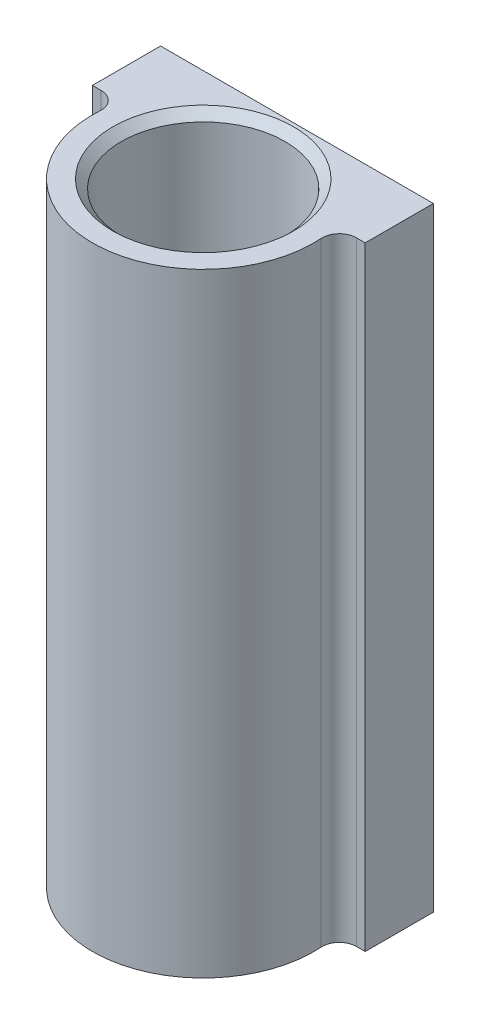
ISO-10303-21;
HEADER;
FILE_DESCRIPTION(('STEP AP214'),'2;1');
FILE_NAME('part.step','',(''),(''),'','','');
FILE_SCHEMA(('AUTOMOTIVE_DESIGN { 1 0 10303 214 1 1 1 1 }'));
ENDSEC;
DATA;
#1=APPLICATION_CONTEXT('core data for automotive mechanical design processes');
#2=APPLICATION_PROTOCOL_DEFINITION('international standard','automotive_design',2000,#1);
#3=PRODUCT_CONTEXT('',#1,'mechanical');
#4=PRODUCT('Part','Part','',(#3));
#5=PRODUCT_RELATED_PRODUCT_CATEGORY('part','',(#4));
#6=PRODUCT_DEFINITION_FORMATION('','',#4);
#7=PRODUCT_DEFINITION_CONTEXT('part definition',#1,'design');
#8=PRODUCT_DEFINITION('design','',#6,#7);
#9=PRODUCT_DEFINITION_SHAPE('','',#8);
#10=(LENGTH_UNIT() NAMED_UNIT(*) SI_UNIT(.MILLI.,.METRE.));
#11=(NAMED_UNIT(*) PLANE_ANGLE_UNIT() SI_UNIT($,.RADIAN.));
#12=(NAMED_UNIT(*) SI_UNIT($,.STERADIAN.) SOLID_ANGLE_UNIT());
#13=UNCERTAINTY_MEASURE_WITH_UNIT(LENGTH_MEASURE(1.E-05),#10,'distance_accuracy_value','');
#14=(GEOMETRIC_REPRESENTATION_CONTEXT(3) GLOBAL_UNCERTAINTY_ASSIGNED_CONTEXT((#13)) GLOBAL_UNIT_ASSIGNED_CONTEXT((#10,
#11,#12)) REPRESENTATION_CONTEXT('',''));
#15=CARTESIAN_POINT('',(0.,0.,0.));
#16=DIRECTION('',(0.,0.,1.));
#17=DIRECTION('',(1.,0.,0.));
#18=AXIS2_PLACEMENT_3D('',#15,#16,#17);
#19=CARTESIAN_POINT('',(-16.,72.,-11.));
#20=DIRECTION('',(0.,0.,1.));
#21=DIRECTION('',(1.,0.,0.));
#22=AXIS2_PLACEMENT_3D('',#19,#20,#21);
#23=PLANE('',#22);
#24=CARTESIAN_POINT('',(-11.,5.,-11.));
#25=DIRECTION('',(0.,0.,1.));
#26=DIRECTION('',(1.,0.,0.));
#27=AXIS2_PLACEMENT_3D('',#24,#25,#26);
#28=CIRCLE('',#27,3.10000000000001);
#29=CARTESIAN_POINT('',(-7.89999999999999,5.,-11.));
#30=VERTEX_POINT('',#29);
#31=EDGE_CURVE('E170',#30,#30,#28,.T.);
#32=ORIENTED_EDGE('',*,*,#31,.T.);
#33=EDGE_LOOP('',(#32));
#34=FACE_BOUND('',#33,.T.);
#35=CARTESIAN_POINT('',(11.,5.,-11.));
#36=DIRECTION('',(0.,0.,1.));
#37=DIRECTION('',(1.,0.,0.));
#38=AXIS2_PLACEMENT_3D('',#35,#36,#37);
#39=CIRCLE('',#38,3.09999999999999);
#40=CARTESIAN_POINT('',(14.1,5.,-11.));
#41=VERTEX_POINT('',#40);
#42=EDGE_CURVE('E167',#41,#41,#39,.T.);
#43=ORIENTED_EDGE('',*,*,#42,.T.);
#44=EDGE_LOOP('',(#43));
#45=FACE_BOUND('',#44,.T.);
#46=CARTESIAN_POINT('',(11.,67.,-11.));
#47=DIRECTION('',(0.,0.,1.));
#48=DIRECTION('',(1.,0.,0.));
#49=AXIS2_PLACEMENT_3D('',#46,#47,#48);
#50=CIRCLE('',#49,3.10000000000001);
#51=CARTESIAN_POINT('',(14.1,67.,-11.));
#52=VERTEX_POINT('',#51);
#53=EDGE_CURVE('E164',#52,#52,#50,.T.);
#54=ORIENTED_EDGE('',*,*,#53,.T.);
#55=EDGE_LOOP('',(#54));
#56=FACE_BOUND('',#55,.T.);
#57=CARTESIAN_POINT('',(-11.,67.,-11.));
#58=DIRECTION('',(0.,0.,1.));
#59=DIRECTION('',(1.,0.,0.));
#60=AXIS2_PLACEMENT_3D('',#57,#58,#59);
#61=CIRCLE('',#60,3.10000000000001);
#62=CARTESIAN_POINT('',(-7.89999999999999,67.,-11.));
#63=VERTEX_POINT('',#62);
#64=EDGE_CURVE('E161',#63,#63,#61,.T.);
#65=ORIENTED_EDGE('',*,*,#64,.T.);
#66=EDGE_LOOP('',(#65));
#67=FACE_BOUND('',#66,.T.);
#68=DIRECTION('',(-1.,0.,0.));
#69=VECTOR('',#68,1.);
#70=CARTESIAN_POINT('',(-16.,0.,-11.));
#71=LINE('',#70,#69);
#72=CARTESIAN_POINT('',(16.,0.,-11.));
#73=VERTEX_POINT('',#72);
#74=CARTESIAN_POINT('',(-16.,0.,-11.));
#75=VERTEX_POINT('',#74);
#76=EDGE_CURVE('E85',#73,#75,#71,.T.);
#77=ORIENTED_EDGE('',*,*,#76,.T.);
#78=DIRECTION('',(0.,-1.,0.));
#79=VECTOR('',#78,1.);
#80=CARTESIAN_POINT('',(-16.,72.,-11.));
#81=LINE('',#80,#79);
#82=CARTESIAN_POINT('',(-16.,72.,-11.));
#83=VERTEX_POINT('',#82);
#84=EDGE_CURVE('E127',#83,#75,#81,.T.);
#85=ORIENTED_EDGE('',*,*,#84,.F.);
#86=DIRECTION('',(-1.,0.,0.));
#87=VECTOR('',#86,1.);
#88=CARTESIAN_POINT('',(-16.,72.,-11.));
#89=LINE('',#88,#87);
#90=CARTESIAN_POINT('',(16.,72.,-11.));
#91=VERTEX_POINT('',#90);
#92=EDGE_CURVE('E50',#91,#83,#89,.T.);
#93=ORIENTED_EDGE('',*,*,#92,.F.);
#94=DIRECTION('',(0.,-1.,0.));
#95=VECTOR('',#94,1.);
#96=CARTESIAN_POINT('',(16.,72.,-11.));
#97=LINE('',#96,#95);
#98=EDGE_CURVE('E123',#91,#73,#97,.T.);
#99=ORIENTED_EDGE('',*,*,#98,.T.);
#100=EDGE_LOOP('',(#77,#85,#93,#99));
#101=FACE_BOUND('',#100,.T.);
#102=ADVANCED_FACE('F33',(#34,#45,#56,#67,#101),#23,.F.);
#103=CARTESIAN_POINT('',(-14.9666295470958,72.,-0.999999999999999));
#104=DIRECTION('',(0.,1.,0.));
#105=DIRECTION('',(0.,0.,1.));
#106=AXIS2_PLACEMENT_3D('',#103,#104,#105);
#107=PLANE('',#106);
#108=CARTESIAN_POINT('',(0.,72.,0.));
#109=DIRECTION('',(0.,1.,0.));
#110=DIRECTION('',(0.,0.,1.));
#111=AXIS2_PLACEMENT_3D('',#108,#109,#110);
#112=CIRCLE('',#111,10.6);
#113=CARTESIAN_POINT('',(0.,72.,10.6));
#114=VERTEX_POINT('',#113);
#115=EDGE_CURVE('E11',#114,#114,#112,.F.);
#116=ORIENTED_EDGE('',*,*,#115,.T.);
#117=EDGE_LOOP('',(#116));
#118=FACE_BOUND('',#117,.T.);
#119=DIRECTION('',(0.,0.,1.));
#120=VECTOR('',#119,1.);
#121=CARTESIAN_POINT('',(-16.,72.,-11.));
#122=LINE('',#121,#120);
#123=CARTESIAN_POINT('',(-16.,72.,-3.));
#124=VERTEX_POINT('',#123);
#125=EDGE_CURVE('E146',#83,#124,#122,.T.);
#126=ORIENTED_EDGE('',*,*,#125,.T.);
#127=DIRECTION('',(1.,0.,0.));
#128=VECTOR('',#127,1.);
#129=CARTESIAN_POINT('',(-16.,72.,-3.));
#130=LINE('',#129,#128);
#131=CARTESIAN_POINT('',(-14.9666295470958,72.,-3.));
#132=VERTEX_POINT('',#131);
#133=EDGE_CURVE('E94',#124,#132,#130,.T.);
#134=ORIENTED_EDGE('',*,*,#133,.T.);
#135=CARTESIAN_POINT('',(-14.9666295470958,72.,-0.999999999999999));
#136=DIRECTION('',(0.,-1.,0.));
#137=DIRECTION('',(0.,0.,1.));
#138=AXIS2_PLACEMENT_3D('',#135,#136,#137);
#139=CIRCLE('',#138,2.);
#140=CARTESIAN_POINT('',(-12.9710789408163,72.,-0.866666666666666));
#141=VERTEX_POINT('',#140);
#142=EDGE_CURVE('E282',#132,#141,#139,.T.);
#143=ORIENTED_EDGE('',*,*,#142,.T.);
#144=CARTESIAN_POINT('',(0.,72.,0.));
#145=DIRECTION('',(0.,1.,0.));
#146=DIRECTION('',(0.,0.,1.));
#147=AXIS2_PLACEMENT_3D('',#144,#145,#146);
#148=CIRCLE('',#147,13.);
#149=CARTESIAN_POINT('',(12.9710789408163,72.,-0.866666666666667));
#150=VERTEX_POINT('',#149);
#151=EDGE_CURVE('E284',#141,#150,#148,.T.);
#152=ORIENTED_EDGE('',*,*,#151,.T.);
#153=CARTESIAN_POINT('',(14.9666295470958,72.,-0.999999999999999));
#154=DIRECTION('',(0.,-1.,0.));
#155=DIRECTION('',(0.,0.,1.));
#156=AXIS2_PLACEMENT_3D('',#153,#154,#155);
#157=CIRCLE('',#156,2.);
#158=CARTESIAN_POINT('',(14.9666295470958,72.,-3.));
#159=VERTEX_POINT('',#158);
#160=EDGE_CURVE('E113',#150,#159,#157,.T.);
#161=ORIENTED_EDGE('',*,*,#160,.T.);
#162=DIRECTION('',(1.,0.,0.));
#163=VECTOR('',#162,1.);
#164=CARTESIAN_POINT('',(14.9666295470958,72.,-3.));
#165=LINE('',#164,#163);
#166=CARTESIAN_POINT('',(16.,72.,-3.));
#167=VERTEX_POINT('',#166);
#168=EDGE_CURVE('E107',#159,#167,#165,.T.);
#169=ORIENTED_EDGE('',*,*,#168,.T.);
#170=DIRECTION('',(0.,0.,-1.));
#171=VECTOR('',#170,1.);
#172=CARTESIAN_POINT('',(16.,72.,-11.));
#173=LINE('',#172,#171);
#174=EDGE_CURVE('E111',#167,#91,#173,.T.);
#175=ORIENTED_EDGE('',*,*,#174,.T.);
#176=ORIENTED_EDGE('',*,*,#92,.T.);
#177=EDGE_LOOP('',(#126,#134,#143,#152,#161,#169,#175,#176));
#178=FACE_BOUND('',#177,.T.);
#179=ADVANCED_FACE('F109',(#118,#178),#107,.T.);
#180=CARTESIAN_POINT('',(-14.9666295470958,0.,-0.999999999999999));
#181=DIRECTION('',(0.,1.,0.));
#182=DIRECTION('',(0.,0.,1.));
#183=AXIS2_PLACEMENT_3D('',#180,#181,#182);
#184=PLANE('',#183);
#185=CARTESIAN_POINT('',(0.,0.,0.));
#186=DIRECTION('',(0.,1.,0.));
#187=DIRECTION('',(0.,0.,1.));
#188=AXIS2_PLACEMENT_3D('',#185,#186,#187);
#189=CIRCLE('',#188,10.6);
#190=CARTESIAN_POINT('',(0.,0.,10.6));
#191=VERTEX_POINT('',#190);
#192=EDGE_CURVE('E185',#191,#191,#189,.T.);
#193=ORIENTED_EDGE('',*,*,#192,.T.);
#194=EDGE_LOOP('',(#193));
#195=FACE_BOUND('',#194,.T.);
#196=DIRECTION('',(0.,0.,1.));
#197=VECTOR('',#196,1.);
#198=CARTESIAN_POINT('',(-16.,0.,-11.));
#199=LINE('',#198,#197);
#200=CARTESIAN_POINT('',(-16.,0.,-3.));
#201=VERTEX_POINT('',#200);
#202=EDGE_CURVE('E131',#75,#201,#199,.T.);
#203=ORIENTED_EDGE('',*,*,#202,.F.);
#204=ORIENTED_EDGE('',*,*,#76,.F.);
#205=DIRECTION('',(0.,0.,-1.));
#206=VECTOR('',#205,1.);
#207=CARTESIAN_POINT('',(16.,0.,-11.));
#208=LINE('',#207,#206);
#209=CARTESIAN_POINT('',(16.,0.,-3.));
#210=VERTEX_POINT('',#209);
#211=EDGE_CURVE('E79',#210,#73,#208,.T.);
#212=ORIENTED_EDGE('',*,*,#211,.F.);
#213=DIRECTION('',(1.,0.,0.));
#214=VECTOR('',#213,1.);
#215=CARTESIAN_POINT('',(14.9666295470958,0.,-3.));
#216=LINE('',#215,#214);
#217=CARTESIAN_POINT('',(14.9666295470958,0.,-3.));
#218=VERTEX_POINT('',#217);
#219=EDGE_CURVE('E121',#218,#210,#216,.T.);
#220=ORIENTED_EDGE('',*,*,#219,.F.);
#221=CARTESIAN_POINT('',(14.9666295470958,0.,-0.999999999999999));
#222=DIRECTION('',(0.,-1.,0.));
#223=DIRECTION('',(0.,0.,1.));
#224=AXIS2_PLACEMENT_3D('',#221,#222,#223);
#225=CIRCLE('',#224,2.);
#226=CARTESIAN_POINT('',(12.9710789408163,0.,-0.866666666666667));
#227=VERTEX_POINT('',#226);
#228=EDGE_CURVE('E141',#227,#218,#225,.T.);
#229=ORIENTED_EDGE('',*,*,#228,.F.);
#230=CARTESIAN_POINT('',(0.,0.,0.));
#231=DIRECTION('',(0.,1.,0.));
#232=DIRECTION('',(0.,0.,1.));
#233=AXIS2_PLACEMENT_3D('',#230,#231,#232);
#234=CIRCLE('',#233,13.);
#235=CARTESIAN_POINT('',(-12.9710789408163,0.,-0.866666666666666));
#236=VERTEX_POINT('',#235);
#237=EDGE_CURVE('E139',#236,#227,#234,.T.);
#238=ORIENTED_EDGE('',*,*,#237,.F.);
#239=CARTESIAN_POINT('',(-14.9666295470958,0.,-0.999999999999999));
#240=DIRECTION('',(0.,-1.,0.));
#241=DIRECTION('',(0.,0.,1.));
#242=AXIS2_PLACEMENT_3D('',#239,#240,#241);
#243=CIRCLE('',#242,2.);
#244=CARTESIAN_POINT('',(-14.9666295470958,0.,-3.));
#245=VERTEX_POINT('',#244);
#246=EDGE_CURVE('E137',#245,#236,#243,.T.);
#247=ORIENTED_EDGE('',*,*,#246,.F.);
#248=DIRECTION('',(1.,0.,0.));
#249=VECTOR('',#248,1.);
#250=CARTESIAN_POINT('',(-16.,0.,-3.));
#251=LINE('',#250,#249);
#252=EDGE_CURVE('E134',#201,#245,#251,.T.);
#253=ORIENTED_EDGE('',*,*,#252,.F.);
#254=EDGE_LOOP('',(#203,#204,#212,#220,#229,#238,#247,#253));
#255=FACE_BOUND('',#254,.T.);
#256=ADVANCED_FACE('F202',(#195,#255),#184,.F.);
#257=CARTESIAN_POINT('',(-16.,72.,-11.));
#258=DIRECTION('',(1.,0.,0.));
#259=DIRECTION('',(0.,0.,-1.));
#260=AXIS2_PLACEMENT_3D('',#257,#258,#259);
#261=PLANE('',#260);
#262=ORIENTED_EDGE('',*,*,#202,.T.);
#263=DIRECTION('',(0.,-1.,0.));
#264=VECTOR('',#263,1.);
#265=CARTESIAN_POINT('',(-16.,72.,-3.));
#266=LINE('',#265,#264);
#267=EDGE_CURVE('E159',#124,#201,#266,.T.);
#268=ORIENTED_EDGE('',*,*,#267,.F.);
#269=ORIENTED_EDGE('',*,*,#125,.F.);
#270=ORIENTED_EDGE('',*,*,#84,.T.);
#271=EDGE_LOOP('',(#262,#268,#269,#270));
#272=FACE_BOUND('',#271,.T.);
#273=ADVANCED_FACE('F205',(#272),#261,.F.);
#274=CARTESIAN_POINT('',(-16.,72.,-3.));
#275=DIRECTION('',(0.,0.,-1.));
#276=DIRECTION('',(-1.,0.,0.));
#277=AXIS2_PLACEMENT_3D('',#274,#275,#276);
#278=PLANE('',#277);
#279=ORIENTED_EDGE('',*,*,#252,.T.);
#280=DIRECTION('',(0.,-1.,0.));
#281=VECTOR('',#280,1.);
#282=CARTESIAN_POINT('',(-14.9666295470958,72.,-3.));
#283=LINE('',#282,#281);
#284=EDGE_CURVE('E156',#132,#245,#283,.T.);
#285=ORIENTED_EDGE('',*,*,#284,.F.);
#286=ORIENTED_EDGE('',*,*,#133,.F.);
#287=ORIENTED_EDGE('',*,*,#267,.T.);
#288=EDGE_LOOP('',(#279,#285,#286,#287));
#289=FACE_BOUND('',#288,.T.);
#290=ADVANCED_FACE('F237',(#289),#278,.F.);
#291=CARTESIAN_POINT('',(-14.9666295470958,72.,-0.999999999999999));
#292=DIRECTION('',(0.,-1.,0.));
#293=DIRECTION('',(0.,0.,-1.));
#294=AXIS2_PLACEMENT_3D('',#291,#292,#293);
#295=CYLINDRICAL_SURFACE('',#294,2.);
#296=ORIENTED_EDGE('',*,*,#246,.T.);
#297=DIRECTION('',(0.,-1.,0.));
#298=VECTOR('',#297,1.);
#299=CARTESIAN_POINT('',(-12.9710789408163,72.,-0.866666666666666));
#300=LINE('',#299,#298);
#301=EDGE_CURVE('E153',#141,#236,#300,.T.);
#302=ORIENTED_EDGE('',*,*,#301,.F.);
#303=ORIENTED_EDGE('',*,*,#142,.F.);
#304=ORIENTED_EDGE('',*,*,#284,.T.);
#305=EDGE_LOOP('',(#296,#302,#303,#304));
#306=FACE_BOUND('',#305,.T.);
#307=ADVANCED_FACE('F233',(#306),#295,.F.);
#308=CARTESIAN_POINT('',(0.,72.,0.));
#309=DIRECTION('',(0.,-1.,0.));
#310=DIRECTION('',(0.,0.,-1.));
#311=AXIS2_PLACEMENT_3D('',#308,#309,#310);
#312=CYLINDRICAL_SURFACE('',#311,13.);
#313=ORIENTED_EDGE('',*,*,#237,.T.);
#314=DIRECTION('',(0.,-1.,0.));
#315=VECTOR('',#314,1.);
#316=CARTESIAN_POINT('',(12.9710789408163,72.,-0.866666666666667));
#317=LINE('',#316,#315);
#318=EDGE_CURVE('E150',#150,#227,#317,.T.);
#319=ORIENTED_EDGE('',*,*,#318,.F.);
#320=ORIENTED_EDGE('',*,*,#151,.F.);
#321=ORIENTED_EDGE('',*,*,#301,.T.);
#322=EDGE_LOOP('',(#313,#319,#320,#321));
#323=FACE_BOUND('',#322,.T.);
#324=ADVANCED_FACE('F229',(#323),#312,.T.);
#325=CARTESIAN_POINT('',(14.9666295470958,72.,-0.999999999999999));
#326=DIRECTION('',(0.,-1.,0.));
#327=DIRECTION('',(0.,0.,-1.));
#328=AXIS2_PLACEMENT_3D('',#325,#326,#327);
#329=CYLINDRICAL_SURFACE('',#328,2.);
#330=ORIENTED_EDGE('',*,*,#228,.T.);
#331=DIRECTION('',(0.,-1.,0.));
#332=VECTOR('',#331,1.);
#333=CARTESIAN_POINT('',(14.9666295470958,72.,-3.));
#334=LINE('',#333,#332);
#335=EDGE_CURVE('E122',#159,#218,#334,.T.);
#336=ORIENTED_EDGE('',*,*,#335,.F.);
#337=ORIENTED_EDGE('',*,*,#160,.F.);
#338=ORIENTED_EDGE('',*,*,#318,.T.);
#339=EDGE_LOOP('',(#330,#336,#337,#338));
#340=FACE_BOUND('',#339,.T.);
#341=ADVANCED_FACE('F226',(#340),#329,.F.);
#342=CARTESIAN_POINT('',(14.9666295470958,72.,-3.));
#343=DIRECTION('',(0.,0.,-1.));
#344=DIRECTION('',(-1.,0.,0.));
#345=AXIS2_PLACEMENT_3D('',#342,#343,#344);
#346=PLANE('',#345);
#347=ORIENTED_EDGE('',*,*,#219,.T.);
#348=DIRECTION('',(0.,-1.,0.));
#349=VECTOR('',#348,1.);
#350=CARTESIAN_POINT('',(16.,72.,-3.));
#351=LINE('',#350,#349);
#352=EDGE_CURVE('E118',#167,#210,#351,.T.);
#353=ORIENTED_EDGE('',*,*,#352,.F.);
#354=ORIENTED_EDGE('',*,*,#168,.F.);
#355=ORIENTED_EDGE('',*,*,#335,.T.);
#356=EDGE_LOOP('',(#347,#353,#354,#355));
#357=FACE_BOUND('',#356,.T.);
#358=ADVANCED_FACE('F119',(#357),#346,.F.);
#359=CARTESIAN_POINT('',(16.,72.,-11.));
#360=DIRECTION('',(-1.,0.,0.));
#361=DIRECTION('',(0.,0.,1.));
#362=AXIS2_PLACEMENT_3D('',#359,#360,#361);
#363=PLANE('',#362);
#364=ORIENTED_EDGE('',*,*,#211,.T.);
#365=ORIENTED_EDGE('',*,*,#98,.F.);
#366=ORIENTED_EDGE('',*,*,#174,.F.);
#367=ORIENTED_EDGE('',*,*,#352,.T.);
#368=EDGE_LOOP('',(#364,#365,#366,#367));
#369=FACE_BOUND('',#368,.T.);
#370=ADVANCED_FACE('F125',(#369),#363,.F.);
#371=CARTESIAN_POINT('',(0.,72.,0.));
#372=DIRECTION('',(0.,-1.,0.));
#373=DIRECTION('',(0.,0.,-1.));
#374=AXIS2_PLACEMENT_3D('',#371,#372,#373);
#375=CYLINDRICAL_SURFACE('',#374,9.6);
#376=CARTESIAN_POINT('',(0.,1.,0.));
#377=DIRECTION('',(0.,1.,0.));
#378=DIRECTION('',(0.,0.,1.));
#379=AXIS2_PLACEMENT_3D('',#376,#377,#378);
#380=CIRCLE('',#379,9.6);
#381=CARTESIAN_POINT('',(0.,1.,9.6));
#382=VERTEX_POINT('',#381);
#383=EDGE_CURVE('E42',#382,#382,#380,.F.);
#384=ORIENTED_EDGE('',*,*,#383,.T.);
#385=EDGE_LOOP('',(#384));
#386=FACE_BOUND('',#385,.T.);
#387=CARTESIAN_POINT('',(0.,71.,0.));
#388=DIRECTION('',(0.,1.,0.));
#389=DIRECTION('',(0.,0.,1.));
#390=AXIS2_PLACEMENT_3D('',#387,#388,#389);
#391=CIRCLE('',#390,9.6);
#392=CARTESIAN_POINT('',(0.,71.,9.6));
#393=VERTEX_POINT('',#392);
#394=EDGE_CURVE('E188',#393,#393,#391,.T.);
#395=ORIENTED_EDGE('',*,*,#394,.T.);
#396=EDGE_LOOP('',(#395));
#397=FACE_BOUND('',#396,.T.);
#398=ADVANCED_FACE('F193',(#386,#397),#375,.F.);
#399=CARTESIAN_POINT('',(-11.,67.,-5.));
#400=DIRECTION('',(0.,0.,-1.));
#401=DIRECTION('',(-1.,0.,0.));
#402=AXIS2_PLACEMENT_3D('',#399,#400,#401);
#403=CYLINDRICAL_SURFACE('',#402,2.60000000000001);
#404=CARTESIAN_POINT('',(-11.,67.,-10.5));
#405=DIRECTION('',(0.,0.,1.));
#406=DIRECTION('',(1.,0.,0.));
#407=AXIS2_PLACEMENT_3D('',#404,#405,#406);
#408=CIRCLE('',#407,2.60000000000001);
#409=CARTESIAN_POINT('',(-8.4,67.,-10.5));
#410=VERTEX_POINT('',#409);
#411=EDGE_CURVE('E182',#410,#410,#408,.F.);
#412=ORIENTED_EDGE('',*,*,#411,.T.);
#413=EDGE_LOOP('',(#412));
#414=FACE_BOUND('',#413,.T.);
#415=CARTESIAN_POINT('',(-11.,67.,-5.));
#416=DIRECTION('',(0.,0.,1.));
#417=DIRECTION('',(1.,0.,0.));
#418=AXIS2_PLACEMENT_3D('',#415,#416,#417);
#419=CIRCLE('',#418,2.60000000000001);
#420=CARTESIAN_POINT('',(-8.4,67.,-5.));
#421=VERTEX_POINT('',#420);
#422=EDGE_CURVE('E135',#421,#421,#419,.T.);
#423=ORIENTED_EDGE('',*,*,#422,.T.);
#424=EDGE_LOOP('',(#423));
#425=FACE_BOUND('',#424,.T.);
#426=ADVANCED_FACE('F265',(#414,#425),#403,.F.);
#427=CARTESIAN_POINT('',(-11.,67.,-5.));
#428=DIRECTION('',(0.,0.,1.));
#429=DIRECTION('',(1.,0.,0.));
#430=AXIS2_PLACEMENT_3D('',#427,#428,#429);
#431=PLANE('',#430);
#432=ORIENTED_EDGE('',*,*,#422,.F.);
#433=EDGE_LOOP('',(#432));
#434=FACE_BOUND('',#433,.T.);
#435=ADVANCED_FACE('F268',(#434),#431,.F.);
#436=CARTESIAN_POINT('',(-11.,5.,-5.));
#437=DIRECTION('',(0.,0.,-1.));
#438=DIRECTION('',(-1.,0.,0.));
#439=AXIS2_PLACEMENT_3D('',#436,#437,#438);
#440=CYLINDRICAL_SURFACE('',#439,2.6);
#441=CARTESIAN_POINT('',(-11.,5.,-10.5));
#442=DIRECTION('',(0.,0.,1.));
#443=DIRECTION('',(1.,0.,0.));
#444=AXIS2_PLACEMENT_3D('',#441,#442,#443);
#445=CIRCLE('',#444,2.6);
#446=CARTESIAN_POINT('',(-8.4,5.,-10.5));
#447=VERTEX_POINT('',#446);
#448=EDGE_CURVE('E173',#447,#447,#445,.F.);
#449=ORIENTED_EDGE('',*,*,#448,.T.);
#450=EDGE_LOOP('',(#449));
#451=FACE_BOUND('',#450,.T.);
#452=CARTESIAN_POINT('',(-11.,5.,-5.));
#453=DIRECTION('',(0.,0.,1.));
#454=DIRECTION('',(1.,0.,0.));
#455=AXIS2_PLACEMENT_3D('',#452,#453,#454);
#456=CIRCLE('',#455,2.6);
#457=CARTESIAN_POINT('',(-8.4,5.,-5.));
#458=VERTEX_POINT('',#457);
#459=EDGE_CURVE('E273',#458,#458,#456,.T.);
#460=ORIENTED_EDGE('',*,*,#459,.T.);
#461=EDGE_LOOP('',(#460));
#462=FACE_BOUND('',#461,.T.);
#463=ADVANCED_FACE('F318',(#451,#462),#440,.F.);
#464=CARTESIAN_POINT('',(-11.,5.,-5.));
#465=DIRECTION('',(0.,0.,1.));
#466=DIRECTION('',(1.,0.,0.));
#467=AXIS2_PLACEMENT_3D('',#464,#465,#466);
#468=PLANE('',#467);
#469=ORIENTED_EDGE('',*,*,#459,.F.);
#470=EDGE_LOOP('',(#469));
#471=FACE_BOUND('',#470,.T.);
#472=ADVANCED_FACE('F314',(#471),#468,.F.);
#473=CARTESIAN_POINT('',(11.,67.,-5.));
#474=DIRECTION('',(0.,0.,-1.));
#475=DIRECTION('',(-1.,0.,0.));
#476=AXIS2_PLACEMENT_3D('',#473,#474,#475);
#477=CYLINDRICAL_SURFACE('',#476,2.6);
#478=CARTESIAN_POINT('',(11.,67.,-10.5));
#479=DIRECTION('',(0.,0.,1.));
#480=DIRECTION('',(1.,0.,0.));
#481=AXIS2_PLACEMENT_3D('',#478,#479,#480);
#482=CIRCLE('',#481,2.6);
#483=CARTESIAN_POINT('',(13.6,67.,-10.5));
#484=VERTEX_POINT('',#483);
#485=EDGE_CURVE('E179',#484,#484,#482,.F.);
#486=ORIENTED_EDGE('',*,*,#485,.T.);
#487=EDGE_LOOP('',(#486));
#488=FACE_BOUND('',#487,.T.);
#489=CARTESIAN_POINT('',(11.,67.,-5.));
#490=DIRECTION('',(0.,0.,1.));
#491=DIRECTION('',(1.,0.,0.));
#492=AXIS2_PLACEMENT_3D('',#489,#490,#491);
#493=CIRCLE('',#492,2.6);
#494=CARTESIAN_POINT('',(13.6,67.,-5.));
#495=VERTEX_POINT('',#494);
#496=EDGE_CURVE('E276',#495,#495,#493,.T.);
#497=ORIENTED_EDGE('',*,*,#496,.T.);
#498=EDGE_LOOP('',(#497));
#499=FACE_BOUND('',#498,.T.);
#500=ADVANCED_FACE('F310',(#488,#499),#477,.F.);
#501=CARTESIAN_POINT('',(11.,67.,-5.));
#502=DIRECTION('',(0.,0.,1.));
#503=DIRECTION('',(1.,0.,0.));
#504=AXIS2_PLACEMENT_3D('',#501,#502,#503);
#505=PLANE('',#504);
#506=ORIENTED_EDGE('',*,*,#496,.F.);
#507=EDGE_LOOP('',(#506));
#508=FACE_BOUND('',#507,.T.);
#509=ADVANCED_FACE('F304',(#508),#505,.F.);
#510=CARTESIAN_POINT('',(11.,5.,-5.));
#511=DIRECTION('',(0.,0.,-1.));
#512=DIRECTION('',(-1.,0.,0.));
#513=AXIS2_PLACEMENT_3D('',#510,#511,#512);
#514=CYLINDRICAL_SURFACE('',#513,2.6);
#515=CARTESIAN_POINT('',(11.,5.,-10.5));
#516=DIRECTION('',(0.,0.,1.));
#517=DIRECTION('',(1.,0.,0.));
#518=AXIS2_PLACEMENT_3D('',#515,#516,#517);
#519=CIRCLE('',#518,2.6);
#520=CARTESIAN_POINT('',(13.6,5.,-10.5));
#521=VERTEX_POINT('',#520);
#522=EDGE_CURVE('E176',#521,#521,#519,.F.);
#523=ORIENTED_EDGE('',*,*,#522,.T.);
#524=EDGE_LOOP('',(#523));
#525=FACE_BOUND('',#524,.T.);
#526=CARTESIAN_POINT('',(11.,5.,-5.));
#527=DIRECTION('',(0.,0.,1.));
#528=DIRECTION('',(1.,0.,0.));
#529=AXIS2_PLACEMENT_3D('',#526,#527,#528);
#530=CIRCLE('',#529,2.6);
#531=CARTESIAN_POINT('',(13.6,5.,-5.));
#532=VERTEX_POINT('',#531);
#533=EDGE_CURVE('E293',#532,#532,#530,.T.);
#534=ORIENTED_EDGE('',*,*,#533,.T.);
#535=EDGE_LOOP('',(#534));
#536=FACE_BOUND('',#535,.T.);
#537=ADVANCED_FACE('F297',(#525,#536),#514,.F.);
#538=CARTESIAN_POINT('',(11.,5.,-5.));
#539=DIRECTION('',(0.,0.,1.));
#540=DIRECTION('',(1.,0.,0.));
#541=AXIS2_PLACEMENT_3D('',#538,#539,#540);
#542=PLANE('',#541);
#543=ORIENTED_EDGE('',*,*,#533,.F.);
#544=EDGE_LOOP('',(#543));
#545=FACE_BOUND('',#544,.T.);
#546=ADVANCED_FACE('F247',(#545),#542,.F.);
#547=CARTESIAN_POINT('',(-11.,5.,-11.));
#548=DIRECTION('',(0.,0.,-1.));
#549=DIRECTION('',(-1.,0.,0.));
#550=AXIS2_PLACEMENT_3D('',#547,#548,#549);
#551=CONICAL_SURFACE('',#550,3.10000000000001,0.785398163397444);
#552=ORIENTED_EDGE('',*,*,#448,.F.);
#553=EDGE_LOOP('',(#552));
#554=FACE_BOUND('',#553,.T.);
#555=ORIENTED_EDGE('',*,*,#31,.F.);
#556=EDGE_LOOP('',(#555));
#557=FACE_BOUND('',#556,.T.);
#558=ADVANCED_FACE('F243',(#554,#557),#551,.F.);
#559=CARTESIAN_POINT('',(11.,5.,-11.));
#560=DIRECTION('',(0.,0.,-1.));
#561=DIRECTION('',(-1.,0.,0.));
#562=AXIS2_PLACEMENT_3D('',#559,#560,#561);
#563=CONICAL_SURFACE('',#562,3.09999999999999,0.785398163397444);
#564=ORIENTED_EDGE('',*,*,#522,.F.);
#565=EDGE_LOOP('',(#564));
#566=FACE_BOUND('',#565,.T.);
#567=ORIENTED_EDGE('',*,*,#42,.F.);
#568=EDGE_LOOP('',(#567));
#569=FACE_BOUND('',#568,.T.);
#570=ADVANCED_FACE('F246',(#566,#569),#563,.F.);
#571=CARTESIAN_POINT('',(11.,67.,-11.));
#572=DIRECTION('',(0.,0.,-1.));
#573=DIRECTION('',(-1.,0.,0.));
#574=AXIS2_PLACEMENT_3D('',#571,#572,#573);
#575=CONICAL_SURFACE('',#574,3.10000000000001,0.785398163397444);
#576=ORIENTED_EDGE('',*,*,#485,.F.);
#577=EDGE_LOOP('',(#576));
#578=FACE_BOUND('',#577,.T.);
#579=ORIENTED_EDGE('',*,*,#53,.F.);
#580=EDGE_LOOP('',(#579));
#581=FACE_BOUND('',#580,.T.);
#582=ADVANCED_FACE('F251',(#578,#581),#575,.F.);
#583=CARTESIAN_POINT('',(-11.,67.,-11.));
#584=DIRECTION('',(0.,0.,-1.));
#585=DIRECTION('',(-1.,0.,0.));
#586=AXIS2_PLACEMENT_3D('',#583,#584,#585);
#587=CONICAL_SURFACE('',#586,3.10000000000001,0.785398163397444);
#588=ORIENTED_EDGE('',*,*,#411,.F.);
#589=EDGE_LOOP('',(#588));
#590=FACE_BOUND('',#589,.T.);
#591=ORIENTED_EDGE('',*,*,#64,.F.);
#592=EDGE_LOOP('',(#591));
#593=FACE_BOUND('',#592,.T.);
#594=ADVANCED_FACE('F199',(#590,#593),#587,.F.);
#595=CARTESIAN_POINT('',(0.,0.,0.));
#596=DIRECTION('',(0.,-1.,0.));
#597=DIRECTION('',(0.,0.,-1.));
#598=AXIS2_PLACEMENT_3D('',#595,#596,#597);
#599=CONICAL_SURFACE('',#598,10.6,0.785398163397444);
#600=ORIENTED_EDGE('',*,*,#383,.F.);
#601=EDGE_LOOP('',(#600));
#602=FACE_BOUND('',#601,.T.);
#603=ORIENTED_EDGE('',*,*,#192,.F.);
#604=EDGE_LOOP('',(#603));
#605=FACE_BOUND('',#604,.T.);
#606=ADVANCED_FACE('F196',(#602,#605),#599,.F.);
#607=CARTESIAN_POINT('',(0.,71.,0.));
#608=DIRECTION('',(0.,1.,0.));
#609=DIRECTION('',(0.,0.,1.));
#610=AXIS2_PLACEMENT_3D('',#607,#608,#609);
#611=CONICAL_SURFACE('',#610,9.6,0.785398163397441);
#612=ORIENTED_EDGE('',*,*,#115,.F.);
#613=EDGE_LOOP('',(#612));
#614=FACE_BOUND('',#613,.T.);
#615=ORIENTED_EDGE('',*,*,#394,.F.);
#616=EDGE_LOOP('',(#615));
#617=FACE_BOUND('',#616,.T.);
#618=ADVANCED_FACE('F35',(#614,#617),#611,.F.);
#619=CLOSED_SHELL('',(#102,#179,#256,#273,#290,#307,#324,#341,#358,#370,#398,#426,#435,#463,
#472,#500,#509,#537,#546,#558,#570,#582,#594,#606,#618));
#620=MANIFOLD_SOLID_BREP('B2',#619);
#621=ADVANCED_BREP_SHAPE_REPRESENTATION('',(#18,#620),#14);
#622=SHAPE_DEFINITION_REPRESENTATION(#9,#621);
ENDSEC;
END-ISO-10303-21;
